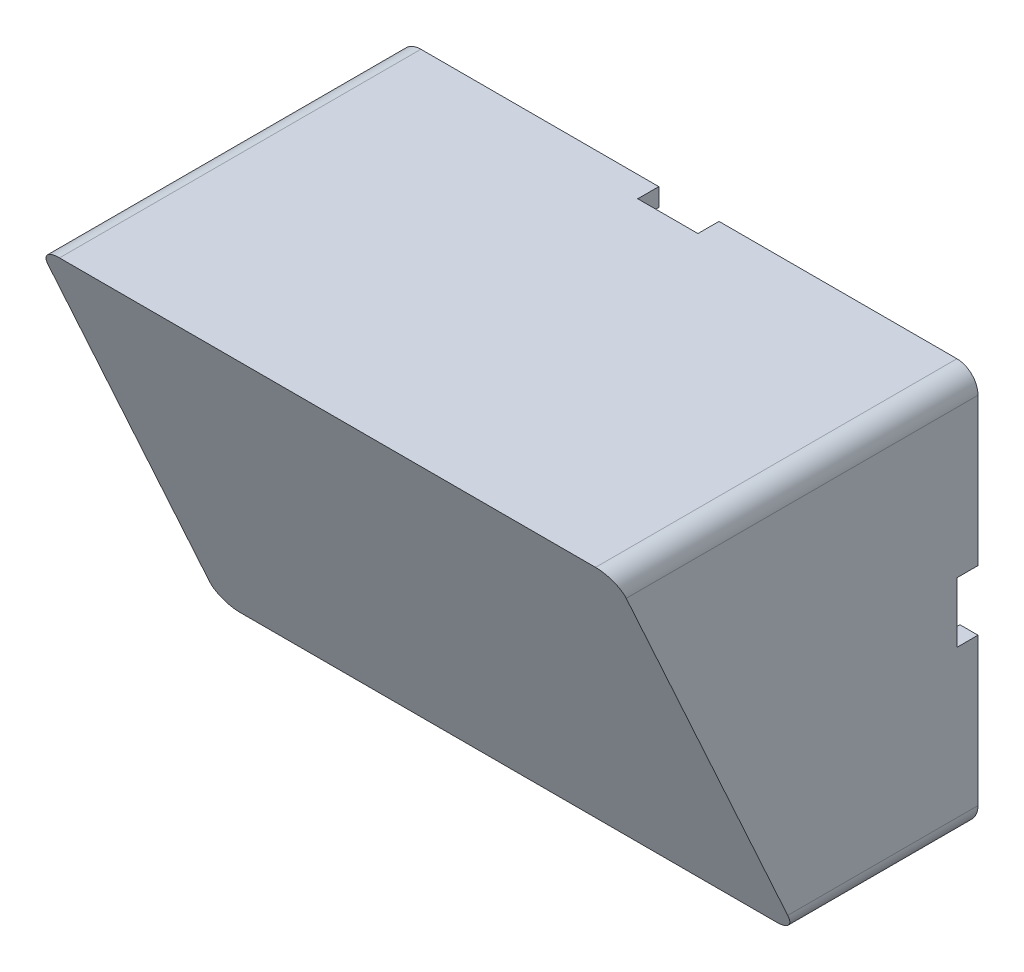
ISO-10303-21;
HEADER;
FILE_DESCRIPTION(('STEP AP214'),'2;1');
FILE_NAME('part.step','',(''),(''),'','','');
FILE_SCHEMA(('AUTOMOTIVE_DESIGN { 1 0 10303 214 1 1 1 1 }'));
ENDSEC;
DATA;
#1=APPLICATION_CONTEXT('core data for automotive mechanical design processes');
#2=APPLICATION_PROTOCOL_DEFINITION('international standard','automotive_design',2000,#1);
#3=PRODUCT_CONTEXT('',#1,'mechanical');
#4=PRODUCT('Part','Part','',(#3));
#5=PRODUCT_RELATED_PRODUCT_CATEGORY('part','',(#4));
#6=PRODUCT_DEFINITION_FORMATION('','',#4);
#7=PRODUCT_DEFINITION_CONTEXT('part definition',#1,'design');
#8=PRODUCT_DEFINITION('design','',#6,#7);
#9=PRODUCT_DEFINITION_SHAPE('','',#8);
#10=(LENGTH_UNIT() NAMED_UNIT(*) SI_UNIT(.MILLI.,.METRE.));
#11=(NAMED_UNIT(*) PLANE_ANGLE_UNIT() SI_UNIT($,.RADIAN.));
#12=(NAMED_UNIT(*) SI_UNIT($,.STERADIAN.) SOLID_ANGLE_UNIT());
#13=UNCERTAINTY_MEASURE_WITH_UNIT(LENGTH_MEASURE(1.E-05),#10,'distance_accuracy_value','');
#14=(GEOMETRIC_REPRESENTATION_CONTEXT(3) GLOBAL_UNCERTAINTY_ASSIGNED_CONTEXT((#13)) GLOBAL_UNIT_ASSIGNED_CONTEXT((#10,
#11,#12)) REPRESENTATION_CONTEXT('',''));
#15=CARTESIAN_POINT('',(0.,0.,0.));
#16=DIRECTION('',(0.,0.,1.));
#17=DIRECTION('',(1.,0.,0.));
#18=AXIS2_PLACEMENT_3D('',#15,#16,#17);
#19=CARTESIAN_POINT('',(0.,0.,0.));
#20=DIRECTION('',(0.,0.,-1.));
#21=DIRECTION('',(-1.,0.,0.));
#22=AXIS2_PLACEMENT_3D('',#19,#20,#21);
#23=PLANE('',#22);
#24=DIRECTION('',(1.,0.,0.));
#25=VECTOR('',#24,1.);
#26=CARTESIAN_POINT('',(0.,0.,0.));
#27=LINE('',#26,#25);
#28=CARTESIAN_POINT('',(3.5,0.,0.));
#29=VERTEX_POINT('',#28);
#30=CARTESIAN_POINT('',(43.,0.,0.));
#31=VERTEX_POINT('',#30);
#32=EDGE_CURVE('E385',#29,#31,#27,.T.);
#33=ORIENTED_EDGE('',*,*,#32,.F.);
#34=CARTESIAN_POINT('',(3.5,3.5,0.));
#35=DIRECTION('',(0.,0.,-1.));
#36=DIRECTION('',(-1.,0.,0.));
#37=AXIS2_PLACEMENT_3D('',#34,#35,#36);
#38=CIRCLE('',#37,3.5);
#39=CARTESIAN_POINT('',(0.,3.5,0.));
#40=VERTEX_POINT('',#39);
#41=EDGE_CURVE('E415',#29,#40,#38,.T.);
#42=ORIENTED_EDGE('',*,*,#41,.T.);
#43=DIRECTION('',(0.,-1.,0.));
#44=VECTOR('',#43,1.);
#45=CARTESIAN_POINT('',(0.,0.,0.));
#46=LINE('',#45,#44);
#47=CARTESIAN_POINT('',(0.,28.,0.));
#48=VERTEX_POINT('',#47);
#49=EDGE_CURVE('E377',#48,#40,#46,.T.);
#50=ORIENTED_EDGE('',*,*,#49,.F.);
#51=DIRECTION('',(1.,0.,0.));
#52=VECTOR('',#51,1.);
#53=CARTESIAN_POINT('',(0.,28.,0.));
#54=LINE('',#53,#52);
#55=CARTESIAN_POINT('',(3.,28.,0.));
#56=VERTEX_POINT('',#55);
#57=EDGE_CURVE('E237',#48,#56,#54,.T.);
#58=ORIENTED_EDGE('',*,*,#57,.T.);
#59=DIRECTION('',(0.,-1.,0.));
#60=VECTOR('',#59,1.);
#61=CARTESIAN_POINT('',(3.,0.,0.));
#62=LINE('',#61,#60);
#63=CARTESIAN_POINT('',(3.,3.,0.));
#64=VERTEX_POINT('',#63);
#65=EDGE_CURVE('E339',#56,#64,#62,.T.);
#66=ORIENTED_EDGE('',*,*,#65,.T.);
#67=DIRECTION('',(1.,0.,0.));
#68=VECTOR('',#67,1.);
#69=CARTESIAN_POINT('',(0.,3.,0.));
#70=LINE('',#69,#68);
#71=CARTESIAN_POINT('',(43.,3.,0.));
#72=VERTEX_POINT('',#71);
#73=EDGE_CURVE('E367',#64,#72,#70,.T.);
#74=ORIENTED_EDGE('',*,*,#73,.T.);
#75=DIRECTION('',(0.,-1.,0.));
#76=VECTOR('',#75,1.);
#77=CARTESIAN_POINT('',(43.,0.,0.));
#78=LINE('',#77,#76);
#79=EDGE_CURVE('E282',#72,#31,#78,.T.);
#80=ORIENTED_EDGE('',*,*,#79,.T.);
#81=EDGE_LOOP('',(#33,#42,#50,#58,#66,#74,#80));
#82=FACE_BOUND('',#81,.T.);
#83=ADVANCED_FACE('F33',(#82),#23,.T.);
#84=CARTESIAN_POINT('',(0.,62.5,0.));
#85=VERTEX_POINT('',#84);
#86=CARTESIAN_POINT('',(0.,38.,0.));
#87=VERTEX_POINT('',#86);
#88=EDGE_CURVE('E243',#85,#87,#46,.T.);
#89=ORIENTED_EDGE('',*,*,#88,.F.);
#90=CARTESIAN_POINT('',(3.5,62.5,0.));
#91=DIRECTION('',(0.,0.,-1.));
#92=DIRECTION('',(-1.,0.,0.));
#93=AXIS2_PLACEMENT_3D('',#90,#91,#92);
#94=CIRCLE('',#93,3.5);
#95=CARTESIAN_POINT('',(3.5,66.,0.));
#96=VERTEX_POINT('',#95);
#97=EDGE_CURVE('E395',#85,#96,#94,.T.);
#98=ORIENTED_EDGE('',*,*,#97,.T.);
#99=DIRECTION('',(-1.,0.,0.));
#100=VECTOR('',#99,1.);
#101=CARTESIAN_POINT('',(0.,66.,0.));
#102=LINE('',#101,#100);
#103=CARTESIAN_POINT('',(43.,66.,0.));
#104=VERTEX_POINT('',#103);
#105=EDGE_CURVE('E390',#104,#96,#102,.T.);
#106=ORIENTED_EDGE('',*,*,#105,.F.);
#107=DIRECTION('',(0.,-1.,0.));
#108=VECTOR('',#107,1.);
#109=CARTESIAN_POINT('',(43.,0.,0.));
#110=LINE('',#109,#108);
#111=CARTESIAN_POINT('',(43.,63.,0.));
#112=VERTEX_POINT('',#111);
#113=EDGE_CURVE('E262',#104,#112,#110,.T.);
#114=ORIENTED_EDGE('',*,*,#113,.T.);
#115=DIRECTION('',(-1.,0.,0.));
#116=VECTOR('',#115,1.);
#117=CARTESIAN_POINT('',(0.,63.,0.));
#118=LINE('',#117,#116);
#119=CARTESIAN_POINT('',(3.,63.,0.));
#120=VERTEX_POINT('',#119);
#121=EDGE_CURVE('E362',#112,#120,#118,.T.);
#122=ORIENTED_EDGE('',*,*,#121,.T.);
#123=CARTESIAN_POINT('',(3.,38.,0.));
#124=VERTEX_POINT('',#123);
#125=EDGE_CURVE('E356',#120,#124,#62,.T.);
#126=ORIENTED_EDGE('',*,*,#125,.T.);
#127=DIRECTION('',(1.,0.,0.));
#128=VECTOR('',#127,1.);
#129=CARTESIAN_POINT('',(0.,38.,0.));
#130=LINE('',#129,#128);
#131=EDGE_CURVE('E269',#87,#124,#130,.T.);
#132=ORIENTED_EDGE('',*,*,#131,.F.);
#133=EDGE_LOOP('',(#89,#98,#106,#114,#122,#126,#132));
#134=FACE_BOUND('',#133,.T.);
#135=ADVANCED_FACE('F516',(#134),#23,.T.);
#136=CARTESIAN_POINT('',(92.5,66.,0.));
#137=VERTEX_POINT('',#136);
#138=CARTESIAN_POINT('',(53.,66.,0.));
#139=VERTEX_POINT('',#138);
#140=EDGE_CURVE('E382',#137,#139,#102,.T.);
#141=ORIENTED_EDGE('',*,*,#140,.F.);
#142=CARTESIAN_POINT('',(92.5,62.5,0.));
#143=DIRECTION('',(0.,0.,-1.));
#144=DIRECTION('',(-1.,0.,0.));
#145=AXIS2_PLACEMENT_3D('',#142,#143,#144);
#146=CIRCLE('',#145,3.5);
#147=CARTESIAN_POINT('',(96.,62.5,0.));
#148=VERTEX_POINT('',#147);
#149=EDGE_CURVE('E11',#137,#148,#146,.T.);
#150=ORIENTED_EDGE('',*,*,#149,.T.);
#151=DIRECTION('',(0.,1.,0.));
#152=VECTOR('',#151,1.);
#153=CARTESIAN_POINT('',(96.,0.,0.));
#154=LINE('',#153,#152);
#155=CARTESIAN_POINT('',(96.,38.,0.));
#156=VERTEX_POINT('',#155);
#157=EDGE_CURVE('E387',#156,#148,#154,.T.);
#158=ORIENTED_EDGE('',*,*,#157,.F.);
#159=DIRECTION('',(1.,0.,0.));
#160=VECTOR('',#159,1.);
#161=CARTESIAN_POINT('',(0.,38.,0.));
#162=LINE('',#161,#160);
#163=CARTESIAN_POINT('',(93.,38.,0.));
#164=VERTEX_POINT('',#163);
#165=EDGE_CURVE('E308',#164,#156,#162,.T.);
#166=ORIENTED_EDGE('',*,*,#165,.F.);
#167=DIRECTION('',(0.,1.,0.));
#168=VECTOR('',#167,1.);
#169=CARTESIAN_POINT('',(93.,0.,0.));
#170=LINE('',#169,#168);
#171=CARTESIAN_POINT('',(93.,63.,0.));
#172=VERTEX_POINT('',#171);
#173=EDGE_CURVE('E366',#164,#172,#170,.T.);
#174=ORIENTED_EDGE('',*,*,#173,.T.);
#175=CARTESIAN_POINT('',(53.,63.,0.));
#176=VERTEX_POINT('',#175);
#177=EDGE_CURVE('E355',#172,#176,#118,.T.);
#178=ORIENTED_EDGE('',*,*,#177,.T.);
#179=DIRECTION('',(0.,-1.,0.));
#180=VECTOR('',#179,1.);
#181=CARTESIAN_POINT('',(53.,0.,0.));
#182=LINE('',#181,#180);
#183=EDGE_CURVE('E253',#139,#176,#182,.T.);
#184=ORIENTED_EDGE('',*,*,#183,.F.);
#185=EDGE_LOOP('',(#141,#150,#158,#166,#174,#178,#184));
#186=FACE_BOUND('',#185,.T.);
#187=ADVANCED_FACE('F496',(#186),#23,.T.);
#188=CARTESIAN_POINT('',(96.,3.5,0.));
#189=VERTEX_POINT('',#188);
#190=CARTESIAN_POINT('',(96.,28.,0.));
#191=VERTEX_POINT('',#190);
#192=EDGE_CURVE('E388',#189,#191,#154,.T.);
#193=ORIENTED_EDGE('',*,*,#192,.F.);
#194=CARTESIAN_POINT('',(92.5,3.5,0.));
#195=DIRECTION('',(0.,0.,-1.));
#196=DIRECTION('',(-1.,0.,0.));
#197=AXIS2_PLACEMENT_3D('',#194,#195,#196);
#198=CIRCLE('',#197,3.5);
#199=CARTESIAN_POINT('',(92.5,0.,0.));
#200=VERTEX_POINT('',#199);
#201=EDGE_CURVE('E41',#189,#200,#198,.T.);
#202=ORIENTED_EDGE('',*,*,#201,.T.);
#203=CARTESIAN_POINT('',(53.,0.,0.));
#204=VERTEX_POINT('',#203);
#205=EDGE_CURVE('E384',#204,#200,#27,.T.);
#206=ORIENTED_EDGE('',*,*,#205,.F.);
#207=DIRECTION('',(0.,-1.,0.));
#208=VECTOR('',#207,1.);
#209=CARTESIAN_POINT('',(53.,0.,0.));
#210=LINE('',#209,#208);
#211=CARTESIAN_POINT('',(53.,3.,0.));
#212=VERTEX_POINT('',#211);
#213=EDGE_CURVE('E291',#212,#204,#210,.T.);
#214=ORIENTED_EDGE('',*,*,#213,.F.);
#215=CARTESIAN_POINT('',(93.,3.,0.));
#216=VERTEX_POINT('',#215);
#217=EDGE_CURVE('E359',#212,#216,#70,.T.);
#218=ORIENTED_EDGE('',*,*,#217,.T.);
#219=CARTESIAN_POINT('',(93.,28.,0.));
#220=VERTEX_POINT('',#219);
#221=EDGE_CURVE('E363',#216,#220,#170,.T.);
#222=ORIENTED_EDGE('',*,*,#221,.T.);
#223=DIRECTION('',(1.,0.,0.));
#224=VECTOR('',#223,1.);
#225=CARTESIAN_POINT('',(0.,28.,0.));
#226=LINE('',#225,#224);
#227=EDGE_CURVE('E318',#220,#191,#226,.T.);
#228=ORIENTED_EDGE('',*,*,#227,.T.);
#229=EDGE_LOOP('',(#193,#202,#206,#214,#218,#222,#228));
#230=FACE_BOUND('',#229,.T.);
#231=ADVANCED_FACE('F424',(#230),#23,.T.);
#232=CARTESIAN_POINT('',(0.,0.,60.));
#233=DIRECTION('',(1.,0.,0.));
#234=DIRECTION('',(0.,0.,-1.));
#235=AXIS2_PLACEMENT_3D('',#232,#233,#234);
#236=PLANE('',#235);
#237=DIRECTION('',(0.,0.910366477462605,0.413802944301184));
#238=VECTOR('',#237,1.);
#239=CARTESIAN_POINT('',(0.,11.3013698630137,35.1369863013699));
#240=LINE('',#239,#238);
#241=CARTESIAN_POINT('',(0.,3.5,31.5909090909091));
#242=VERTEX_POINT('',#241);
#243=CARTESIAN_POINT('',(0.,62.5,58.4090909090909));
#244=VERTEX_POINT('',#243);
#245=EDGE_CURVE('E375',#242,#244,#240,.T.);
#246=ORIENTED_EDGE('',*,*,#245,.T.);
#247=DIRECTION('',(0.,0.,-1.));
#248=VECTOR('',#247,1.);
#249=CARTESIAN_POINT('',(0.,62.5,60.));
#250=LINE('',#249,#248);
#251=EDGE_CURVE('E393',#244,#85,#250,.T.);
#252=ORIENTED_EDGE('',*,*,#251,.T.);
#253=ORIENTED_EDGE('',*,*,#88,.T.);
#254=DIRECTION('',(0.,0.,-1.));
#255=VECTOR('',#254,1.);
#256=CARTESIAN_POINT('',(0.,38.,3.5));
#257=LINE('',#256,#255);
#258=CARTESIAN_POINT('',(0.,38.,3.5));
#259=VERTEX_POINT('',#258);
#260=EDGE_CURVE('E221',#259,#87,#257,.T.);
#261=ORIENTED_EDGE('',*,*,#260,.F.);
#262=DIRECTION('',(0.,1.,0.));
#263=VECTOR('',#262,1.);
#264=CARTESIAN_POINT('',(0.,0.,3.5));
#265=LINE('',#264,#263);
#266=CARTESIAN_POINT('',(0.,28.,3.5));
#267=VERTEX_POINT('',#266);
#268=EDGE_CURVE('E229',#267,#259,#265,.T.);
#269=ORIENTED_EDGE('',*,*,#268,.F.);
#270=DIRECTION('',(0.,0.,-1.));
#271=VECTOR('',#270,1.);
#272=CARTESIAN_POINT('',(0.,28.,3.5));
#273=LINE('',#272,#271);
#274=EDGE_CURVE('E353',#267,#48,#273,.T.);
#275=ORIENTED_EDGE('',*,*,#274,.T.);
#276=ORIENTED_EDGE('',*,*,#49,.T.);
#277=DIRECTION('',(0.,0.,-1.));
#278=VECTOR('',#277,1.);
#279=CARTESIAN_POINT('',(0.,3.5,60.));
#280=LINE('',#279,#278);
#281=EDGE_CURVE('E381',#40,#242,#280,.F.);
#282=ORIENTED_EDGE('',*,*,#281,.T.);
#283=EDGE_LOOP('',(#246,#252,#253,#261,#269,#275,#276,#282));
#284=FACE_BOUND('',#283,.T.);
#285=ADVANCED_FACE('F240',(#284),#236,.F.);
#286=CARTESIAN_POINT('',(0.,0.,60.));
#287=DIRECTION('',(0.,1.,0.));
#288=DIRECTION('',(0.,0.,1.));
#289=AXIS2_PLACEMENT_3D('',#286,#287,#288);
#290=PLANE('',#289);
#291=DIRECTION('',(1.,0.,0.));
#292=VECTOR('',#291,1.);
#293=CARTESIAN_POINT('',(-3.99999999999998,0.,30.));
#294=LINE('',#293,#292);
#295=CARTESIAN_POINT('',(3.5,0.,30.));
#296=VERTEX_POINT('',#295);
#297=CARTESIAN_POINT('',(92.5,0.,30.));
#298=VERTEX_POINT('',#297);
#299=EDGE_CURVE('E372',#296,#298,#294,.T.);
#300=ORIENTED_EDGE('',*,*,#299,.F.);
#301=DIRECTION('',(0.,0.,-1.));
#302=VECTOR('',#301,1.);
#303=CARTESIAN_POINT('',(3.5,0.,60.));
#304=LINE('',#303,#302);
#305=EDGE_CURVE('E412',#296,#29,#304,.T.);
#306=ORIENTED_EDGE('',*,*,#305,.T.);
#307=ORIENTED_EDGE('',*,*,#32,.T.);
#308=DIRECTION('',(0.,0.,-1.));
#309=VECTOR('',#308,1.);
#310=CARTESIAN_POINT('',(43.,0.,3.5));
#311=LINE('',#310,#309);
#312=CARTESIAN_POINT('',(43.,0.,3.5));
#313=VERTEX_POINT('',#312);
#314=EDGE_CURVE('E298',#313,#31,#311,.T.);
#315=ORIENTED_EDGE('',*,*,#314,.F.);
#316=DIRECTION('',(-1.,0.,0.));
#317=VECTOR('',#316,1.);
#318=CARTESIAN_POINT('',(0.,0.,3.5));
#319=LINE('',#318,#317);
#320=CARTESIAN_POINT('',(53.,0.,3.5));
#321=VERTEX_POINT('',#320);
#322=EDGE_CURVE('E285',#321,#313,#319,.T.);
#323=ORIENTED_EDGE('',*,*,#322,.F.);
#324=DIRECTION('',(0.,0.,-1.));
#325=VECTOR('',#324,1.);
#326=CARTESIAN_POINT('',(53.,0.,3.5));
#327=LINE('',#326,#325);
#328=EDGE_CURVE('E301',#321,#204,#327,.T.);
#329=ORIENTED_EDGE('',*,*,#328,.T.);
#330=ORIENTED_EDGE('',*,*,#205,.T.);
#331=DIRECTION('',(0.,0.,-1.));
#332=VECTOR('',#331,1.);
#333=CARTESIAN_POINT('',(92.5,0.,60.));
#334=LINE('',#333,#332);
#335=EDGE_CURVE('E410',#200,#298,#334,.F.);
#336=ORIENTED_EDGE('',*,*,#335,.T.);
#337=EDGE_LOOP('',(#300,#306,#307,#315,#323,#329,#330,#336));
#338=FACE_BOUND('',#337,.T.);
#339=ADVANCED_FACE('F428',(#338),#290,.F.);
#340=CARTESIAN_POINT('',(96.,0.,60.));
#341=DIRECTION('',(-1.,0.,0.));
#342=DIRECTION('',(0.,0.,1.));
#343=AXIS2_PLACEMENT_3D('',#340,#341,#342);
#344=PLANE('',#343);
#345=DIRECTION('',(0.,0.910366477462605,0.413802944301184));
#346=VECTOR('',#345,1.);
#347=CARTESIAN_POINT('',(96.,66.,60.));
#348=LINE('',#347,#346);
#349=CARTESIAN_POINT('',(96.,3.49999999999999,31.5909090909091));
#350=VERTEX_POINT('',#349);
#351=CARTESIAN_POINT('',(96.,62.5,58.4090909090909));
#352=VERTEX_POINT('',#351);
#353=EDGE_CURVE('E334',#350,#352,#348,.T.);
#354=ORIENTED_EDGE('',*,*,#353,.F.);
#355=DIRECTION('',(0.,0.,-1.));
#356=VECTOR('',#355,1.);
#357=CARTESIAN_POINT('',(96.,3.5,60.));
#358=LINE('',#357,#356);
#359=EDGE_CURVE('E419',#350,#189,#358,.T.);
#360=ORIENTED_EDGE('',*,*,#359,.T.);
#361=ORIENTED_EDGE('',*,*,#192,.T.);
#362=DIRECTION('',(0.,0.,-1.));
#363=VECTOR('',#362,1.);
#364=CARTESIAN_POINT('',(96.,28.,3.5));
#365=LINE('',#364,#363);
#366=CARTESIAN_POINT('',(96.,28.,3.5));
#367=VERTEX_POINT('',#366);
#368=EDGE_CURVE('E293',#367,#191,#365,.T.);
#369=ORIENTED_EDGE('',*,*,#368,.F.);
#370=DIRECTION('',(0.,-1.,0.));
#371=VECTOR('',#370,1.);
#372=CARTESIAN_POINT('',(96.,0.,3.5));
#373=LINE('',#372,#371);
#374=CARTESIAN_POINT('',(96.,38.,3.5));
#375=VERTEX_POINT('',#374);
#376=EDGE_CURVE('E314',#375,#367,#373,.T.);
#377=ORIENTED_EDGE('',*,*,#376,.F.);
#378=DIRECTION('',(0.,0.,-1.));
#379=VECTOR('',#378,1.);
#380=CARTESIAN_POINT('',(96.,38.,3.5));
#381=LINE('',#380,#379);
#382=EDGE_CURVE('E324',#375,#156,#381,.T.);
#383=ORIENTED_EDGE('',*,*,#382,.T.);
#384=ORIENTED_EDGE('',*,*,#157,.T.);
#385=DIRECTION('',(0.,0.,-1.));
#386=VECTOR('',#385,1.);
#387=CARTESIAN_POINT('',(96.,62.5,60.));
#388=LINE('',#387,#386);
#389=EDGE_CURVE('E417',#148,#352,#388,.F.);
#390=ORIENTED_EDGE('',*,*,#389,.T.);
#391=EDGE_LOOP('',(#354,#360,#361,#369,#377,#383,#384,#390));
#392=FACE_BOUND('',#391,.T.);
#393=ADVANCED_FACE('F437',(#392),#344,.F.);
#394=CARTESIAN_POINT('',(0.,66.,60.));
#395=DIRECTION('',(0.,-1.,0.));
#396=DIRECTION('',(0.,0.,-1.));
#397=AXIS2_PLACEMENT_3D('',#394,#395,#396);
#398=PLANE('',#397);
#399=ORIENTED_EDGE('',*,*,#105,.T.);
#400=DIRECTION('',(0.,0.,-1.));
#401=VECTOR('',#400,1.);
#402=CARTESIAN_POINT('',(3.5,66.,60.));
#403=LINE('',#402,#401);
#404=CARTESIAN_POINT('',(3.5,66.,60.));
#405=VERTEX_POINT('',#404);
#406=EDGE_CURVE('E400',#96,#405,#403,.F.);
#407=ORIENTED_EDGE('',*,*,#406,.T.);
#408=DIRECTION('',(-1.,0.,0.));
#409=VECTOR('',#408,1.);
#410=CARTESIAN_POINT('',(0.,66.,60.));
#411=LINE('',#410,#409);
#412=CARTESIAN_POINT('',(92.5,66.,60.));
#413=VERTEX_POINT('',#412);
#414=EDGE_CURVE('E378',#413,#405,#411,.T.);
#415=ORIENTED_EDGE('',*,*,#414,.F.);
#416=DIRECTION('',(0.,0.,-1.));
#417=VECTOR('',#416,1.);
#418=CARTESIAN_POINT('',(92.5,66.,60.));
#419=LINE('',#418,#417);
#420=EDGE_CURVE('E397',#413,#137,#419,.T.);
#421=ORIENTED_EDGE('',*,*,#420,.T.);
#422=ORIENTED_EDGE('',*,*,#140,.T.);
#423=DIRECTION('',(0.,0.,-1.));
#424=VECTOR('',#423,1.);
#425=CARTESIAN_POINT('',(53.,66.,3.5));
#426=LINE('',#425,#424);
#427=CARTESIAN_POINT('',(53.,66.,3.5));
#428=VERTEX_POINT('',#427);
#429=EDGE_CURVE('E273',#428,#139,#426,.T.);
#430=ORIENTED_EDGE('',*,*,#429,.F.);
#431=DIRECTION('',(1.,0.,0.));
#432=VECTOR('',#431,1.);
#433=CARTESIAN_POINT('',(0.,66.,3.5));
#434=LINE('',#433,#432);
#435=CARTESIAN_POINT('',(43.,66.,3.5));
#436=VERTEX_POINT('',#435);
#437=EDGE_CURVE('E252',#436,#428,#434,.T.);
#438=ORIENTED_EDGE('',*,*,#437,.F.);
#439=DIRECTION('',(0.,0.,-1.));
#440=VECTOR('',#439,1.);
#441=CARTESIAN_POINT('',(43.,66.,3.5));
#442=LINE('',#441,#440);
#443=EDGE_CURVE('E261',#436,#104,#442,.T.);
#444=ORIENTED_EDGE('',*,*,#443,.T.);
#445=EDGE_LOOP('',(#399,#407,#415,#421,#422,#430,#438,#444));
#446=FACE_BOUND('',#445,.T.);
#447=ADVANCED_FACE('F445',(#446),#398,.F.);
#448=CARTESIAN_POINT('',(3.,0.,60.));
#449=DIRECTION('',(1.,0.,0.));
#450=DIRECTION('',(0.,0.,-1.));
#451=AXIS2_PLACEMENT_3D('',#448,#449,#450);
#452=PLANE('',#451);
#453=ORIENTED_EDGE('',*,*,#65,.F.);
#454=DIRECTION('',(0.,0.,-1.));
#455=VECTOR('',#454,1.);
#456=CARTESIAN_POINT('',(3.,28.,3.5));
#457=LINE('',#456,#455);
#458=CARTESIAN_POINT('',(3.,28.,3.5));
#459=VERTEX_POINT('',#458);
#460=EDGE_CURVE('E245',#459,#56,#457,.T.);
#461=ORIENTED_EDGE('',*,*,#460,.F.);
#462=DIRECTION('',(0.,-1.,0.));
#463=VECTOR('',#462,1.);
#464=CARTESIAN_POINT('',(3.,0.,3.5));
#465=LINE('',#464,#463);
#466=CARTESIAN_POINT('',(3.,38.,3.5));
#467=VERTEX_POINT('',#466);
#468=EDGE_CURVE('E228',#467,#459,#465,.T.);
#469=ORIENTED_EDGE('',*,*,#468,.F.);
#470=DIRECTION('',(0.,0.,-1.));
#471=VECTOR('',#470,1.);
#472=CARTESIAN_POINT('',(3.,38.,3.5));
#473=LINE('',#472,#471);
#474=EDGE_CURVE('E224',#467,#124,#473,.T.);
#475=ORIENTED_EDGE('',*,*,#474,.T.);
#476=ORIENTED_EDGE('',*,*,#125,.F.);
#477=DIRECTION('',(0.,0.,-1.));
#478=VECTOR('',#477,1.);
#479=CARTESIAN_POINT('',(3.,63.,60.));
#480=LINE('',#479,#478);
#481=CARTESIAN_POINT('',(3.,63.,55.3409874617469));
#482=VERTEX_POINT('',#481);
#483=EDGE_CURVE('E341',#482,#120,#480,.T.);
#484=ORIENTED_EDGE('',*,*,#483,.F.);
#485=DIRECTION('',(0.,0.910366477462605,0.413802944301184));
#486=VECTOR('',#485,1.);
#487=CARTESIAN_POINT('',(3.,12.5427786959173,32.4058868689821));
#488=LINE('',#487,#486);
#489=CARTESIAN_POINT('',(3.,3.,28.0682601890197));
#490=VERTEX_POINT('',#489);
#491=EDGE_CURVE('E336',#490,#482,#488,.T.);
#492=ORIENTED_EDGE('',*,*,#491,.F.);
#493=DIRECTION('',(0.,0.,-1.));
#494=VECTOR('',#493,1.);
#495=CARTESIAN_POINT('',(3.,3.,60.));
#496=LINE('',#495,#494);
#497=EDGE_CURVE('E331',#490,#64,#496,.T.);
#498=ORIENTED_EDGE('',*,*,#497,.T.);
#499=EDGE_LOOP('',(#453,#461,#469,#475,#476,#484,#492,#498));
#500=FACE_BOUND('',#499,.T.);
#501=ADVANCED_FACE('F521',(#500),#452,.T.);
#502=CARTESIAN_POINT('',(0.,3.,60.));
#503=DIRECTION('',(0.,1.,0.));
#504=DIRECTION('',(0.,0.,1.));
#505=AXIS2_PLACEMENT_3D('',#502,#503,#504);
#506=PLANE('',#505);
#507=DIRECTION('',(1.,0.,0.));
#508=VECTOR('',#507,1.);
#509=CARTESIAN_POINT('',(0.,3.,3.5));
#510=LINE('',#509,#508);
#511=CARTESIAN_POINT('',(43.,3.,3.5));
#512=VERTEX_POINT('',#511);
#513=CARTESIAN_POINT('',(53.,3.,3.5));
#514=VERTEX_POINT('',#513);
#515=EDGE_CURVE('E278',#512,#514,#510,.T.);
#516=ORIENTED_EDGE('',*,*,#515,.F.);
#517=DIRECTION('',(0.,0.,-1.));
#518=VECTOR('',#517,1.);
#519=CARTESIAN_POINT('',(43.,3.,3.5));
#520=LINE('',#519,#518);
#521=EDGE_CURVE('E265',#512,#72,#520,.T.);
#522=ORIENTED_EDGE('',*,*,#521,.T.);
#523=ORIENTED_EDGE('',*,*,#73,.F.);
#524=ORIENTED_EDGE('',*,*,#497,.F.);
#525=DIRECTION('',(1.,0.,0.));
#526=VECTOR('',#525,1.);
#527=CARTESIAN_POINT('',(-3.99999999999998,3.,28.0682601890197));
#528=LINE('',#527,#526);
#529=CARTESIAN_POINT('',(93.,3.,28.0682601890197));
#530=VERTEX_POINT('',#529);
#531=EDGE_CURVE('E340',#490,#530,#528,.T.);
#532=ORIENTED_EDGE('',*,*,#531,.T.);
#533=DIRECTION('',(0.,0.,-1.));
#534=VECTOR('',#533,1.);
#535=CARTESIAN_POINT('',(93.,3.,60.));
#536=LINE('',#535,#534);
#537=EDGE_CURVE('E335',#530,#216,#536,.T.);
#538=ORIENTED_EDGE('',*,*,#537,.T.);
#539=ORIENTED_EDGE('',*,*,#217,.F.);
#540=DIRECTION('',(0.,0.,-1.));
#541=VECTOR('',#540,1.);
#542=CARTESIAN_POINT('',(53.,3.,3.5));
#543=LINE('',#542,#541);
#544=EDGE_CURVE('E290',#514,#212,#543,.T.);
#545=ORIENTED_EDGE('',*,*,#544,.F.);
#546=EDGE_LOOP('',(#516,#522,#523,#524,#532,#538,#539,#545));
#547=FACE_BOUND('',#546,.T.);
#548=ADVANCED_FACE('F468',(#547),#506,.T.);
#549=CARTESIAN_POINT('',(93.,0.,60.));
#550=DIRECTION('',(-1.,0.,0.));
#551=DIRECTION('',(0.,0.,1.));
#552=AXIS2_PLACEMENT_3D('',#549,#550,#551);
#553=PLANE('',#552);
#554=DIRECTION('',(0.,1.,0.));
#555=VECTOR('',#554,1.);
#556=CARTESIAN_POINT('',(93.,0.,3.5));
#557=LINE('',#556,#555);
#558=CARTESIAN_POINT('',(93.,28.,3.5));
#559=VERTEX_POINT('',#558);
#560=CARTESIAN_POINT('',(93.,38.,3.5));
#561=VERTEX_POINT('',#560);
#562=EDGE_CURVE('E307',#559,#561,#557,.T.);
#563=ORIENTED_EDGE('',*,*,#562,.F.);
#564=DIRECTION('',(0.,0.,-1.));
#565=VECTOR('',#564,1.);
#566=CARTESIAN_POINT('',(93.,28.,3.5));
#567=LINE('',#566,#565);
#568=EDGE_CURVE('E317',#559,#220,#567,.T.);
#569=ORIENTED_EDGE('',*,*,#568,.T.);
#570=ORIENTED_EDGE('',*,*,#221,.F.);
#571=ORIENTED_EDGE('',*,*,#537,.F.);
#572=DIRECTION('',(0.,0.910366477462605,0.413802944301184));
#573=VECTOR('',#572,1.);
#574=CARTESIAN_POINT('',(93.,67.2414088329036,57.2689005676122));
#575=LINE('',#574,#573);
#576=CARTESIAN_POINT('',(93.,63.,55.3409874617469));
#577=VERTEX_POINT('',#576);
#578=EDGE_CURVE('E349',#530,#577,#575,.T.);
#579=ORIENTED_EDGE('',*,*,#578,.T.);
#580=DIRECTION('',(0.,0.,-1.));
#581=VECTOR('',#580,1.);
#582=CARTESIAN_POINT('',(93.,63.,60.));
#583=LINE('',#582,#581);
#584=EDGE_CURVE('E344',#577,#172,#583,.T.);
#585=ORIENTED_EDGE('',*,*,#584,.T.);
#586=ORIENTED_EDGE('',*,*,#173,.F.);
#587=DIRECTION('',(0.,0.,-1.));
#588=VECTOR('',#587,1.);
#589=CARTESIAN_POINT('',(93.,38.,3.5));
#590=LINE('',#589,#588);
#591=EDGE_CURVE('E327',#561,#164,#590,.T.);
#592=ORIENTED_EDGE('',*,*,#591,.F.);
#593=EDGE_LOOP('',(#563,#569,#570,#571,#579,#585,#586,#592));
#594=FACE_BOUND('',#593,.T.);
#595=ADVANCED_FACE('F482',(#594),#553,.T.);
#596=CARTESIAN_POINT('',(0.,63.,60.));
#597=DIRECTION('',(0.,-1.,0.));
#598=DIRECTION('',(0.,0.,-1.));
#599=AXIS2_PLACEMENT_3D('',#596,#597,#598);
#600=PLANE('',#599);
#601=ORIENTED_EDGE('',*,*,#121,.F.);
#602=DIRECTION('',(0.,0.,-1.));
#603=VECTOR('',#602,1.);
#604=CARTESIAN_POINT('',(43.,63.,3.5));
#605=LINE('',#604,#603);
#606=CARTESIAN_POINT('',(43.,63.,3.5));
#607=VERTEX_POINT('',#606);
#608=EDGE_CURVE('E267',#607,#112,#605,.T.);
#609=ORIENTED_EDGE('',*,*,#608,.F.);
#610=DIRECTION('',(-1.,0.,0.));
#611=VECTOR('',#610,1.);
#612=CARTESIAN_POINT('',(0.,63.,3.5));
#613=LINE('',#612,#611);
#614=CARTESIAN_POINT('',(53.,63.,3.5));
#615=VERTEX_POINT('',#614);
#616=EDGE_CURVE('E258',#615,#607,#613,.T.);
#617=ORIENTED_EDGE('',*,*,#616,.F.);
#618=DIRECTION('',(0.,0.,-1.));
#619=VECTOR('',#618,1.);
#620=CARTESIAN_POINT('',(53.,63.,3.5));
#621=LINE('',#620,#619);
#622=EDGE_CURVE('E270',#615,#176,#621,.T.);
#623=ORIENTED_EDGE('',*,*,#622,.T.);
#624=ORIENTED_EDGE('',*,*,#177,.F.);
#625=ORIENTED_EDGE('',*,*,#584,.F.);
#626=DIRECTION('',(-1.,0.,0.));
#627=VECTOR('',#626,1.);
#628=CARTESIAN_POINT('',(-3.99999999999998,63.,55.3409874617469));
#629=LINE('',#628,#627);
#630=EDGE_CURVE('E345',#577,#482,#629,.T.);
#631=ORIENTED_EDGE('',*,*,#630,.T.);
#632=ORIENTED_EDGE('',*,*,#483,.T.);
#633=EDGE_LOOP('',(#601,#609,#617,#623,#624,#625,#631,#632));
#634=FACE_BOUND('',#633,.T.);
#635=ADVANCED_FACE('F501',(#634),#600,.T.);
#636=CARTESIAN_POINT('',(-3.99999999999998,66.,60.));
#637=DIRECTION('',(0.,0.413802944301184,-0.910366477462605));
#638=DIRECTION('',(0.,0.910366477462605,0.413802944301184));
#639=AXIS2_PLACEMENT_3D('',#636,#637,#638);
#640=PLANE('',#639);
#641=ORIENTED_EDGE('',*,*,#414,.T.);
#642=CARTESIAN_POINT('',(3.5,62.5,58.4090909090909));
#643=DIRECTION('',(0.,0.413802944301184,-0.910366477462605));
#644=DIRECTION('',(0.,-0.910366477462605,-0.413802944301184));
#645=AXIS2_PLACEMENT_3D('',#642,#643,#644);
#646=ELLIPSE('',#645,3.84460553705282,3.5);
#647=EDGE_CURVE('E408',#405,#244,#646,.F.);
#648=ORIENTED_EDGE('',*,*,#647,.T.);
#649=ORIENTED_EDGE('',*,*,#245,.F.);
#650=CARTESIAN_POINT('',(3.5,3.5,31.5909090909091));
#651=DIRECTION('',(0.,0.413802944301184,-0.910366477462605));
#652=DIRECTION('',(0.,-0.910366477462605,-0.413802944301184));
#653=AXIS2_PLACEMENT_3D('',#650,#651,#652);
#654=ELLIPSE('',#653,3.84460553705282,3.5);
#655=EDGE_CURVE('E406',#242,#296,#654,.F.);
#656=ORIENTED_EDGE('',*,*,#655,.T.);
#657=ORIENTED_EDGE('',*,*,#299,.T.);
#658=CARTESIAN_POINT('',(92.5,3.5,31.5909090909091));
#659=DIRECTION('',(0.,0.413802944301184,-0.910366477462605));
#660=DIRECTION('',(0.,-0.910366477462605,-0.413802944301184));
#661=AXIS2_PLACEMENT_3D('',#658,#659,#660);
#662=ELLIPSE('',#661,3.84460553705282,3.5);
#663=EDGE_CURVE('E404',#298,#350,#662,.F.);
#664=ORIENTED_EDGE('',*,*,#663,.T.);
#665=ORIENTED_EDGE('',*,*,#353,.T.);
#666=CARTESIAN_POINT('',(92.5,62.5,58.4090909090909));
#667=DIRECTION('',(0.,0.413802944301184,-0.910366477462605));
#668=DIRECTION('',(0.,-0.910366477462605,-0.413802944301184));
#669=AXIS2_PLACEMENT_3D('',#666,#667,#668);
#670=ELLIPSE('',#669,3.84460553705282,3.5);
#671=EDGE_CURVE('E402',#352,#413,#670,.F.);
#672=ORIENTED_EDGE('',*,*,#671,.T.);
#673=EDGE_LOOP('',(#641,#648,#649,#656,#657,#664,#665,#672));
#674=FACE_BOUND('',#673,.T.);
#675=ADVANCED_FACE('F434',(#674),#640,.F.);
#676=CARTESIAN_POINT('',(-3.99999999999998,67.2414088329036,57.2689005676122));
#677=DIRECTION('',(0.,0.413802944301184,-0.910366477462605));
#678=DIRECTION('',(0.,0.910366477462605,0.413802944301184));
#679=AXIS2_PLACEMENT_3D('',#676,#677,#678);
#680=PLANE('',#679);
#681=ORIENTED_EDGE('',*,*,#531,.F.);
#682=ORIENTED_EDGE('',*,*,#491,.T.);
#683=ORIENTED_EDGE('',*,*,#630,.F.);
#684=ORIENTED_EDGE('',*,*,#578,.F.);
#685=EDGE_LOOP('',(#681,#682,#683,#684));
#686=FACE_BOUND('',#685,.T.);
#687=ADVANCED_FACE('F531',(#686),#680,.T.);
#688=CARTESIAN_POINT('',(43.,0.,3.5));
#689=DIRECTION('',(1.,0.,0.));
#690=DIRECTION('',(0.,0.,-1.));
#691=AXIS2_PLACEMENT_3D('',#688,#689,#690);
#692=PLANE('',#691);
#693=ORIENTED_EDGE('',*,*,#113,.F.);
#694=ORIENTED_EDGE('',*,*,#443,.F.);
#695=DIRECTION('',(0.,-1.,0.));
#696=VECTOR('',#695,1.);
#697=CARTESIAN_POINT('',(43.,0.,3.5));
#698=LINE('',#697,#696);
#699=EDGE_CURVE('E250',#436,#607,#698,.T.);
#700=ORIENTED_EDGE('',*,*,#699,.T.);
#701=ORIENTED_EDGE('',*,*,#608,.T.);
#702=EDGE_LOOP('',(#693,#694,#700,#701));
#703=FACE_BOUND('',#702,.T.);
#704=ADVANCED_FACE('F514',(#703),#692,.T.);
#705=CARTESIAN_POINT('',(53.,0.,3.5));
#706=DIRECTION('',(1.,0.,0.));
#707=DIRECTION('',(0.,0.,-1.));
#708=AXIS2_PLACEMENT_3D('',#705,#706,#707);
#709=PLANE('',#708);
#710=ORIENTED_EDGE('',*,*,#183,.T.);
#711=ORIENTED_EDGE('',*,*,#622,.F.);
#712=DIRECTION('',(0.,-1.,0.));
#713=VECTOR('',#712,1.);
#714=CARTESIAN_POINT('',(53.,0.,3.5));
#715=LINE('',#714,#713);
#716=EDGE_CURVE('E256',#428,#615,#715,.T.);
#717=ORIENTED_EDGE('',*,*,#716,.F.);
#718=ORIENTED_EDGE('',*,*,#429,.T.);
#719=EDGE_LOOP('',(#710,#711,#717,#718));
#720=FACE_BOUND('',#719,.T.);
#721=ADVANCED_FACE('F506',(#720),#709,.F.);
#722=CARTESIAN_POINT('',(0.,0.,3.5));
#723=DIRECTION('',(0.,0.,-1.));
#724=DIRECTION('',(-1.,0.,0.));
#725=AXIS2_PLACEMENT_3D('',#722,#723,#724);
#726=PLANE('',#725);
#727=ORIENTED_EDGE('',*,*,#699,.F.);
#728=ORIENTED_EDGE('',*,*,#437,.T.);
#729=ORIENTED_EDGE('',*,*,#716,.T.);
#730=ORIENTED_EDGE('',*,*,#616,.T.);
#731=EDGE_LOOP('',(#727,#728,#729,#730));
#732=FACE_BOUND('',#731,.T.);
#733=ADVANCED_FACE('F511',(#732),#726,.T.);
#734=CARTESIAN_POINT('',(0.,28.,3.5));
#735=DIRECTION('',(0.,1.,0.));
#736=DIRECTION('',(0.,0.,1.));
#737=AXIS2_PLACEMENT_3D('',#734,#735,#736);
#738=PLANE('',#737);
#739=ORIENTED_EDGE('',*,*,#227,.F.);
#740=ORIENTED_EDGE('',*,*,#568,.F.);
#741=DIRECTION('',(1.,0.,0.));
#742=VECTOR('',#741,1.);
#743=CARTESIAN_POINT('',(0.,28.,3.5));
#744=LINE('',#743,#742);
#745=EDGE_CURVE('E305',#559,#367,#744,.T.);
#746=ORIENTED_EDGE('',*,*,#745,.T.);
#747=ORIENTED_EDGE('',*,*,#368,.T.);
#748=EDGE_LOOP('',(#739,#740,#746,#747));
#749=FACE_BOUND('',#748,.T.);
#750=ADVANCED_FACE('F486',(#749),#738,.T.);
#751=CARTESIAN_POINT('',(0.,38.,3.5));
#752=DIRECTION('',(0.,1.,0.));
#753=DIRECTION('',(0.,0.,1.));
#754=AXIS2_PLACEMENT_3D('',#751,#752,#753);
#755=PLANE('',#754);
#756=ORIENTED_EDGE('',*,*,#165,.T.);
#757=ORIENTED_EDGE('',*,*,#382,.F.);
#758=DIRECTION('',(1.,0.,0.));
#759=VECTOR('',#758,1.);
#760=CARTESIAN_POINT('',(0.,38.,3.5));
#761=LINE('',#760,#759);
#762=EDGE_CURVE('E311',#561,#375,#761,.T.);
#763=ORIENTED_EDGE('',*,*,#762,.F.);
#764=ORIENTED_EDGE('',*,*,#591,.T.);
#765=EDGE_LOOP('',(#756,#757,#763,#764));
#766=FACE_BOUND('',#765,.T.);
#767=ADVANCED_FACE('F493',(#766),#755,.F.);
#768=CARTESIAN_POINT('',(0.,0.,3.5));
#769=DIRECTION('',(0.,0.,-1.));
#770=DIRECTION('',(-1.,0.,0.));
#771=AXIS2_PLACEMENT_3D('',#768,#769,#770);
#772=PLANE('',#771);
#773=ORIENTED_EDGE('',*,*,#745,.F.);
#774=ORIENTED_EDGE('',*,*,#562,.T.);
#775=ORIENTED_EDGE('',*,*,#762,.T.);
#776=ORIENTED_EDGE('',*,*,#376,.T.);
#777=EDGE_LOOP('',(#773,#774,#775,#776));
#778=FACE_BOUND('',#777,.T.);
#779=ADVANCED_FACE('F490',(#778),#772,.T.);
#780=CARTESIAN_POINT('',(43.,0.,3.5));
#781=DIRECTION('',(1.,0.,0.));
#782=DIRECTION('',(0.,0.,-1.));
#783=AXIS2_PLACEMENT_3D('',#780,#781,#782);
#784=PLANE('',#783);
#785=ORIENTED_EDGE('',*,*,#79,.F.);
#786=ORIENTED_EDGE('',*,*,#521,.F.);
#787=DIRECTION('',(0.,-1.,0.));
#788=VECTOR('',#787,1.);
#789=CARTESIAN_POINT('',(43.,0.,3.5));
#790=LINE('',#789,#788);
#791=EDGE_CURVE('E288',#512,#313,#790,.T.);
#792=ORIENTED_EDGE('',*,*,#791,.T.);
#793=ORIENTED_EDGE('',*,*,#314,.T.);
#794=EDGE_LOOP('',(#785,#786,#792,#793));
#795=FACE_BOUND('',#794,.T.);
#796=ADVANCED_FACE('F465',(#795),#784,.T.);
#797=CARTESIAN_POINT('',(53.,0.,3.5));
#798=DIRECTION('',(1.,0.,0.));
#799=DIRECTION('',(0.,0.,-1.));
#800=AXIS2_PLACEMENT_3D('',#797,#798,#799);
#801=PLANE('',#800);
#802=ORIENTED_EDGE('',*,*,#213,.T.);
#803=ORIENTED_EDGE('',*,*,#328,.F.);
#804=DIRECTION('',(0.,-1.,0.));
#805=VECTOR('',#804,1.);
#806=CARTESIAN_POINT('',(53.,0.,3.5));
#807=LINE('',#806,#805);
#808=EDGE_CURVE('E281',#514,#321,#807,.T.);
#809=ORIENTED_EDGE('',*,*,#808,.F.);
#810=ORIENTED_EDGE('',*,*,#544,.T.);
#811=EDGE_LOOP('',(#802,#803,#809,#810));
#812=FACE_BOUND('',#811,.T.);
#813=ADVANCED_FACE('F475',(#812),#801,.F.);
#814=CARTESIAN_POINT('',(0.,0.,3.5));
#815=DIRECTION('',(0.,0.,-1.));
#816=DIRECTION('',(-1.,0.,0.));
#817=AXIS2_PLACEMENT_3D('',#814,#815,#816);
#818=PLANE('',#817);
#819=ORIENTED_EDGE('',*,*,#515,.T.);
#820=ORIENTED_EDGE('',*,*,#808,.T.);
#821=ORIENTED_EDGE('',*,*,#322,.T.);
#822=ORIENTED_EDGE('',*,*,#791,.F.);
#823=EDGE_LOOP('',(#819,#820,#821,#822));
#824=FACE_BOUND('',#823,.T.);
#825=ADVANCED_FACE('F473',(#824),#818,.T.);
#826=CARTESIAN_POINT('',(0.,28.,3.5));
#827=DIRECTION('',(0.,1.,0.));
#828=DIRECTION('',(-1.,0.,0.));
#829=AXIS2_PLACEMENT_3D('',#826,#827,#828);
#830=PLANE('',#829);
#831=ORIENTED_EDGE('',*,*,#57,.F.);
#832=ORIENTED_EDGE('',*,*,#274,.F.);
#833=DIRECTION('',(1.,0.,0.));
#834=VECTOR('',#833,1.);
#835=CARTESIAN_POINT('',(0.,28.,3.5));
#836=LINE('',#835,#834);
#837=EDGE_CURVE('E234',#267,#459,#836,.T.);
#838=ORIENTED_EDGE('',*,*,#837,.T.);
#839=ORIENTED_EDGE('',*,*,#460,.T.);
#840=EDGE_LOOP('',(#831,#832,#838,#839));
#841=FACE_BOUND('',#840,.T.);
#842=ADVANCED_FACE('F529',(#841),#830,.T.);
#843=CARTESIAN_POINT('',(0.,38.,3.5));
#844=DIRECTION('',(0.,1.,0.));
#845=DIRECTION('',(0.,0.,1.));
#846=AXIS2_PLACEMENT_3D('',#843,#844,#845);
#847=PLANE('',#846);
#848=ORIENTED_EDGE('',*,*,#131,.T.);
#849=ORIENTED_EDGE('',*,*,#474,.F.);
#850=DIRECTION('',(1.,0.,0.));
#851=VECTOR('',#850,1.);
#852=CARTESIAN_POINT('',(0.,38.,3.5));
#853=LINE('',#852,#851);
#854=EDGE_CURVE('E217',#259,#467,#853,.T.);
#855=ORIENTED_EDGE('',*,*,#854,.F.);
#856=ORIENTED_EDGE('',*,*,#260,.T.);
#857=EDGE_LOOP('',(#848,#849,#855,#856));
#858=FACE_BOUND('',#857,.T.);
#859=ADVANCED_FACE('F219',(#858),#847,.F.);
#860=CARTESIAN_POINT('',(0.,0.,3.5));
#861=DIRECTION('',(0.,0.,-1.));
#862=DIRECTION('',(-1.,0.,0.));
#863=AXIS2_PLACEMENT_3D('',#860,#861,#862);
#864=PLANE('',#863);
#865=ORIENTED_EDGE('',*,*,#268,.T.);
#866=ORIENTED_EDGE('',*,*,#854,.T.);
#867=ORIENTED_EDGE('',*,*,#468,.T.);
#868=ORIENTED_EDGE('',*,*,#837,.F.);
#869=EDGE_LOOP('',(#865,#866,#867,#868));
#870=FACE_BOUND('',#869,.T.);
#871=ADVANCED_FACE('F233',(#870),#864,.T.);
#872=CARTESIAN_POINT('',(3.5,62.5,60.));
#873=DIRECTION('',(0.,0.,-1.));
#874=DIRECTION('',(-1.,0.,0.));
#875=AXIS2_PLACEMENT_3D('',#872,#873,#874);
#876=CYLINDRICAL_SURFACE('',#875,3.5);
#877=ORIENTED_EDGE('',*,*,#647,.F.);
#878=ORIENTED_EDGE('',*,*,#406,.F.);
#879=ORIENTED_EDGE('',*,*,#97,.F.);
#880=ORIENTED_EDGE('',*,*,#251,.F.);
#881=EDGE_LOOP('',(#877,#878,#879,#880));
#882=FACE_BOUND('',#881,.T.);
#883=ADVANCED_FACE('F449',(#882),#876,.T.);
#884=CARTESIAN_POINT('',(3.5,3.5,60.));
#885=DIRECTION('',(0.,0.,-1.));
#886=DIRECTION('',(-1.,0.,0.));
#887=AXIS2_PLACEMENT_3D('',#884,#885,#886);
#888=CYLINDRICAL_SURFACE('',#887,3.5);
#889=ORIENTED_EDGE('',*,*,#655,.F.);
#890=ORIENTED_EDGE('',*,*,#281,.F.);
#891=ORIENTED_EDGE('',*,*,#41,.F.);
#892=ORIENTED_EDGE('',*,*,#305,.F.);
#893=EDGE_LOOP('',(#889,#890,#891,#892));
#894=FACE_BOUND('',#893,.T.);
#895=ADVANCED_FACE('F457',(#894),#888,.T.);
#896=CARTESIAN_POINT('',(92.5,3.5,60.));
#897=DIRECTION('',(0.,0.,-1.));
#898=DIRECTION('',(-1.,0.,0.));
#899=AXIS2_PLACEMENT_3D('',#896,#897,#898);
#900=CYLINDRICAL_SURFACE('',#899,3.5);
#901=ORIENTED_EDGE('',*,*,#663,.F.);
#902=ORIENTED_EDGE('',*,*,#335,.F.);
#903=ORIENTED_EDGE('',*,*,#201,.F.);
#904=ORIENTED_EDGE('',*,*,#359,.F.);
#905=EDGE_LOOP('',(#901,#902,#903,#904));
#906=FACE_BOUND('',#905,.T.);
#907=ADVANCED_FACE('F431',(#906),#900,.T.);
#908=CARTESIAN_POINT('',(92.5,62.5,60.));
#909=DIRECTION('',(0.,0.,-1.));
#910=DIRECTION('',(-1.,0.,0.));
#911=AXIS2_PLACEMENT_3D('',#908,#909,#910);
#912=CYLINDRICAL_SURFACE('',#911,3.5);
#913=ORIENTED_EDGE('',*,*,#671,.F.);
#914=ORIENTED_EDGE('',*,*,#389,.F.);
#915=ORIENTED_EDGE('',*,*,#149,.F.);
#916=ORIENTED_EDGE('',*,*,#420,.F.);
#917=EDGE_LOOP('',(#913,#914,#915,#916));
#918=FACE_BOUND('',#917,.T.);
#919=ADVANCED_FACE('F35',(#918),#912,.T.);
#920=CLOSED_SHELL('',(#83,#135,#187,#231,#285,#339,#393,#447,#501,#548,#595,#635,#675,#687,#704,
#721,#733,#750,#767,#779,#796,#813,#825,#842,#859,#871,#883,#895,#907,#919));
#921=MANIFOLD_SOLID_BREP('B2',#920);
#922=ADVANCED_BREP_SHAPE_REPRESENTATION('',(#18,#921),#14);
#923=SHAPE_DEFINITION_REPRESENTATION(#9,#922);
ENDSEC;
END-ISO-10303-21;
